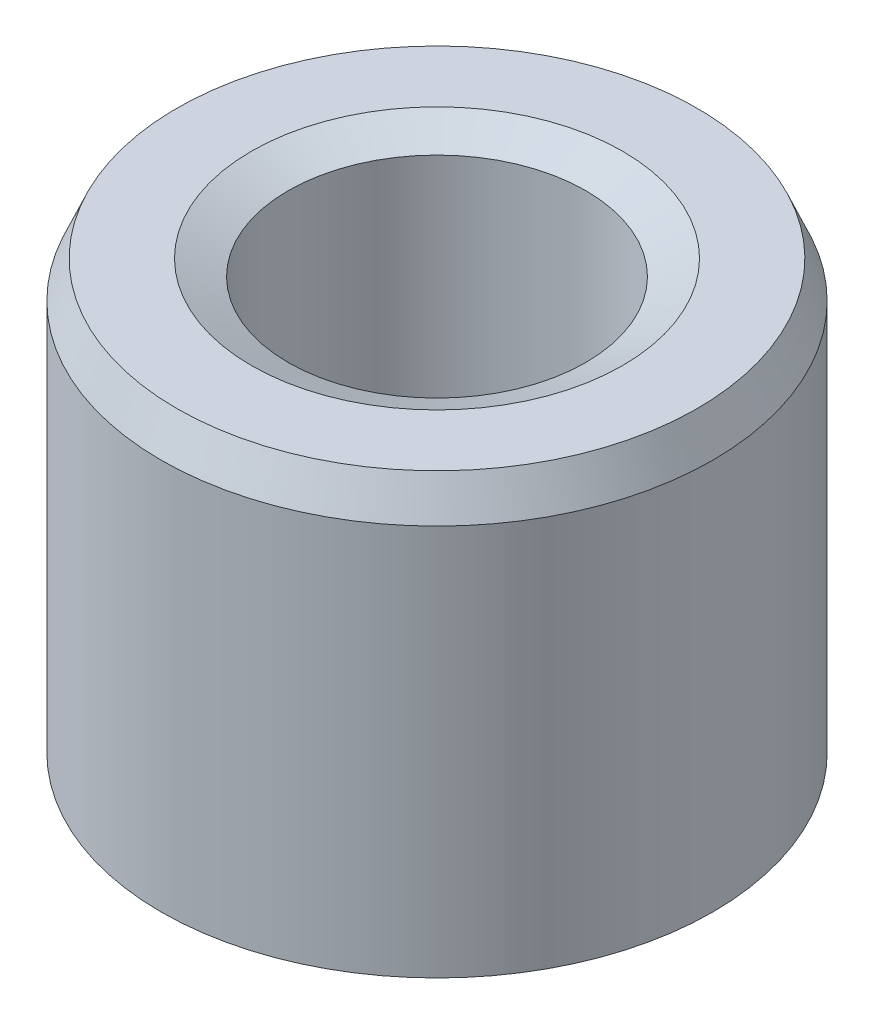
ISO-10303-21;
HEADER;
FILE_DESCRIPTION(('STEP AP214'),'2;1');
FILE_NAME('part.step','',(''),(''),'','','');
FILE_SCHEMA(('AUTOMOTIVE_DESIGN { 1 0 10303 214 1 1 1 1 }'));
ENDSEC;
DATA;
#1=APPLICATION_CONTEXT('core data for automotive mechanical design processes');
#2=APPLICATION_PROTOCOL_DEFINITION('international standard','automotive_design',2000,#1);
#3=PRODUCT_CONTEXT('',#1,'mechanical');
#4=PRODUCT('Part','Part','',(#3));
#5=PRODUCT_RELATED_PRODUCT_CATEGORY('part','',(#4));
#6=PRODUCT_DEFINITION_FORMATION('','',#4);
#7=PRODUCT_DEFINITION_CONTEXT('part definition',#1,'design');
#8=PRODUCT_DEFINITION('design','',#6,#7);
#9=PRODUCT_DEFINITION_SHAPE('','',#8);
#10=(LENGTH_UNIT() NAMED_UNIT(*) SI_UNIT(.MILLI.,.METRE.));
#11=(NAMED_UNIT(*) PLANE_ANGLE_UNIT() SI_UNIT($,.RADIAN.));
#12=(NAMED_UNIT(*) SI_UNIT($,.STERADIAN.) SOLID_ANGLE_UNIT());
#13=UNCERTAINTY_MEASURE_WITH_UNIT(LENGTH_MEASURE(1.E-05),#10,'distance_accuracy_value','');
#14=(GEOMETRIC_REPRESENTATION_CONTEXT(3) GLOBAL_UNCERTAINTY_ASSIGNED_CONTEXT((#13)) GLOBAL_UNIT_ASSIGNED_CONTEXT((#10,
#11,#12)) REPRESENTATION_CONTEXT('',''));
#15=CARTESIAN_POINT('',(0.,0.,0.));
#16=DIRECTION('',(0.,0.,1.));
#17=DIRECTION('',(1.,0.,0.));
#18=AXIS2_PLACEMENT_3D('',#15,#16,#17);
#19=CARTESIAN_POINT('',(0.,36.2004482002707,0.));
#20=DIRECTION('',(0.,-1.,0.));
#21=DIRECTION('',(0.,0.,-1.));
#22=AXIS2_PLACEMENT_3D('',#19,#20,#21);
#23=CYLINDRICAL_SURFACE('',#22,22.5);
#24=CARTESIAN_POINT('',(0.,1.28417331315657,0.));
#25=DIRECTION('',(0.,1.,0.));
#26=DIRECTION('',(0.,0.,1.));
#27=AXIS2_PLACEMENT_3D('',#24,#25,#26);
#28=CIRCLE('',#27,22.5);
#29=CARTESIAN_POINT('',(0.,1.28417331315657,22.5));
#30=VERTEX_POINT('',#29);
#31=EDGE_CURVE('E10',#30,#30,#28,.T.);
#32=ORIENTED_EDGE('',*,*,#31,.T.);
#33=EDGE_LOOP('',(#32));
#34=FACE_BOUND('',#33,.T.);
#35=CARTESIAN_POINT('',(0.,33.1991903360314,0.));
#36=DIRECTION('',(0.,1.,0.));
#37=DIRECTION('',(0.,0.,1.));
#38=AXIS2_PLACEMENT_3D('',#35,#36,#37);
#39=CIRCLE('',#38,22.5);
#40=CARTESIAN_POINT('',(0.,33.1991903360314,22.5));
#41=VERTEX_POINT('',#40);
#42=EDGE_CURVE('E50',#41,#41,#39,.F.);
#43=ORIENTED_EDGE('',*,*,#42,.T.);
#44=EDGE_LOOP('',(#43));
#45=FACE_BOUND('',#44,.T.);
#46=ADVANCED_FACE('F39',(#34,#45),#23,.T.);
#47=CARTESIAN_POINT('',(0.,36.2004482002707,0.));
#48=DIRECTION('',(0.,1.,0.));
#49=DIRECTION('',(0.,0.,1.));
#50=AXIS2_PLACEMENT_3D('',#47,#48,#49);
#51=PLANE('',#50);
#52=CARTESIAN_POINT('',(0.,36.2004482002707,0.));
#53=DIRECTION('',(0.,1.,0.));
#54=DIRECTION('',(0.,0.,1.));
#55=AXIS2_PLACEMENT_3D('',#52,#53,#54);
#56=CIRCLE('',#55,15.139926730484);
#57=CARTESIAN_POINT('',(0.,36.2004482002707,15.139926730484));
#58=VERTEX_POINT('',#57);
#59=EDGE_CURVE('E58',#58,#58,#56,.F.);
#60=ORIENTED_EDGE('',*,*,#59,.T.);
#61=EDGE_LOOP('',(#60));
#62=FACE_BOUND('',#61,.T.);
#63=CARTESIAN_POINT('',(0.,36.2004482002707,0.));
#64=DIRECTION('',(0.,1.,0.));
#65=DIRECTION('',(0.,0.,1.));
#66=AXIS2_PLACEMENT_3D('',#63,#64,#65);
#67=CIRCLE('',#66,21.2158266868434);
#68=CARTESIAN_POINT('',(0.,36.2004482002707,21.2158266868434));
#69=VERTEX_POINT('',#68);
#70=EDGE_CURVE('E61',#69,#69,#67,.T.);
#71=ORIENTED_EDGE('',*,*,#70,.T.);
#72=EDGE_LOOP('',(#71));
#73=FACE_BOUND('',#72,.T.);
#74=ADVANCED_FACE('F88',(#62,#73),#51,.T.);
#75=CARTESIAN_POINT('',(0.,0.,0.));
#76=DIRECTION('',(0.,1.,0.));
#77=DIRECTION('',(0.,0.,1.));
#78=AXIS2_PLACEMENT_3D('',#75,#76,#77);
#79=PLANE('',#78);
#80=CARTESIAN_POINT('',(0.,0.,0.));
#81=DIRECTION('',(0.,1.,0.));
#82=DIRECTION('',(0.,0.,1.));
#83=AXIS2_PLACEMENT_3D('',#80,#81,#82);
#84=CIRCLE('',#83,13.4228421794012);
#85=CARTESIAN_POINT('',(0.,0.,13.4228421794012));
#86=VERTEX_POINT('',#85);
#87=EDGE_CURVE('E51',#86,#86,#84,.T.);
#88=ORIENTED_EDGE('',*,*,#87,.T.);
#89=EDGE_LOOP('',(#88));
#90=FACE_BOUND('',#89,.T.);
#91=CARTESIAN_POINT('',(0.,0.,0.));
#92=DIRECTION('',(0.,1.,0.));
#93=DIRECTION('',(0.,0.,1.));
#94=AXIS2_PLACEMENT_3D('',#91,#92,#93);
#95=CIRCLE('',#94,19.4987421357607);
#96=CARTESIAN_POINT('',(0.,0.,19.4987421357607));
#97=VERTEX_POINT('',#96);
#98=EDGE_CURVE('E54',#97,#97,#95,.F.);
#99=ORIENTED_EDGE('',*,*,#98,.T.);
#100=EDGE_LOOP('',(#99));
#101=FACE_BOUND('',#100,.T.);
#102=ADVANCED_FACE('F83',(#90,#101),#79,.F.);
#103=CARTESIAN_POINT('',(0.,36.2004482002707,0.));
#104=DIRECTION('',(0.,-1.,0.));
#105=DIRECTION('',(0.,0.,-1.));
#106=AXIS2_PLACEMENT_3D('',#103,#104,#105);
#107=CYLINDRICAL_SURFACE('',#106,12.1386688662447);
#108=CARTESIAN_POINT('',(0.,34.9162748871141,0.));
#109=DIRECTION('',(0.,1.,0.));
#110=DIRECTION('',(0.,0.,1.));
#111=AXIS2_PLACEMENT_3D('',#108,#109,#110);
#112=CIRCLE('',#111,12.1386688662447);
#113=CARTESIAN_POINT('',(0.,34.9162748871141,12.1386688662447));
#114=VERTEX_POINT('',#113);
#115=EDGE_CURVE('E67',#114,#114,#112,.T.);
#116=ORIENTED_EDGE('',*,*,#115,.T.);
#117=EDGE_LOOP('',(#116));
#118=FACE_BOUND('',#117,.T.);
#119=CARTESIAN_POINT('',(0.,3.00125786423931,0.));
#120=DIRECTION('',(0.,1.,0.));
#121=DIRECTION('',(0.,0.,1.));
#122=AXIS2_PLACEMENT_3D('',#119,#120,#121);
#123=CIRCLE('',#122,12.1386688662447);
#124=CARTESIAN_POINT('',(0.,3.00125786423931,12.1386688662447));
#125=VERTEX_POINT('',#124);
#126=EDGE_CURVE('E69',#125,#125,#123,.F.);
#127=ORIENTED_EDGE('',*,*,#126,.T.);
#128=EDGE_LOOP('',(#127));
#129=FACE_BOUND('',#128,.T.);
#130=ADVANCED_FACE('F71',(#118,#129),#107,.F.);
#131=CARTESIAN_POINT('',(0.,34.9162748871141,0.));
#132=DIRECTION('',(0.,1.,0.));
#133=DIRECTION('',(0.,0.,1.));
#134=AXIS2_PLACEMENT_3D('',#131,#132,#133);
#135=CONICAL_SURFACE('',#134,12.1386688662447,1.16649020515012);
#136=ORIENTED_EDGE('',*,*,#59,.F.);
#137=EDGE_LOOP('',(#136));
#138=FACE_BOUND('',#137,.T.);
#139=ORIENTED_EDGE('',*,*,#115,.F.);
#140=EDGE_LOOP('',(#139));
#141=FACE_BOUND('',#140,.T.);
#142=ADVANCED_FACE('F77',(#138,#141),#135,.F.);
#143=CARTESIAN_POINT('',(0.,0.,0.));
#144=DIRECTION('',(0.,-1.,0.));
#145=DIRECTION('',(0.,0.,-1.));
#146=AXIS2_PLACEMENT_3D('',#143,#144,#145);
#147=CONICAL_SURFACE('',#146,13.4228421794012,0.404306121644781);
#148=ORIENTED_EDGE('',*,*,#126,.F.);
#149=EDGE_LOOP('',(#148));
#150=FACE_BOUND('',#149,.T.);
#151=ORIENTED_EDGE('',*,*,#87,.F.);
#152=EDGE_LOOP('',(#151));
#153=FACE_BOUND('',#152,.T.);
#154=ADVANCED_FACE('F73',(#150,#153),#147,.F.);
#155=CARTESIAN_POINT('',(0.,1.28417331315657,0.));
#156=DIRECTION('',(0.,1.,0.));
#157=DIRECTION('',(0.,0.,1.));
#158=AXIS2_PLACEMENT_3D('',#155,#156,#157);
#159=CONICAL_SURFACE('',#158,22.5,1.16649020515011);
#160=ORIENTED_EDGE('',*,*,#98,.F.);
#161=EDGE_LOOP('',(#160));
#162=FACE_BOUND('',#161,.T.);
#163=ORIENTED_EDGE('',*,*,#31,.F.);
#164=EDGE_LOOP('',(#163));
#165=FACE_BOUND('',#164,.T.);
#166=ADVANCED_FACE('F76',(#162,#165),#159,.T.);
#167=CARTESIAN_POINT('',(0.,36.2004482002707,0.));
#168=DIRECTION('',(0.,-1.,0.));
#169=DIRECTION('',(0.,0.,-1.));
#170=AXIS2_PLACEMENT_3D('',#167,#168,#169);
#171=CONICAL_SURFACE('',#170,21.2158266868434,0.404306121644781);
#172=ORIENTED_EDGE('',*,*,#42,.F.);
#173=EDGE_LOOP('',(#172));
#174=FACE_BOUND('',#173,.T.);
#175=ORIENTED_EDGE('',*,*,#70,.F.);
#176=EDGE_LOOP('',(#175));
#177=FACE_BOUND('',#176,.T.);
#178=ADVANCED_FACE('F45',(#174,#177),#171,.T.);
#179=CLOSED_SHELL('',(#46,#74,#102,#130,#142,#154,#166,#178));
#180=MANIFOLD_SOLID_BREP('B2',#179);
#181=ADVANCED_BREP_SHAPE_REPRESENTATION('',(#18,#180),#14);
#182=SHAPE_DEFINITION_REPRESENTATION(#9,#181);
ENDSEC;
END-ISO-10303-21;
